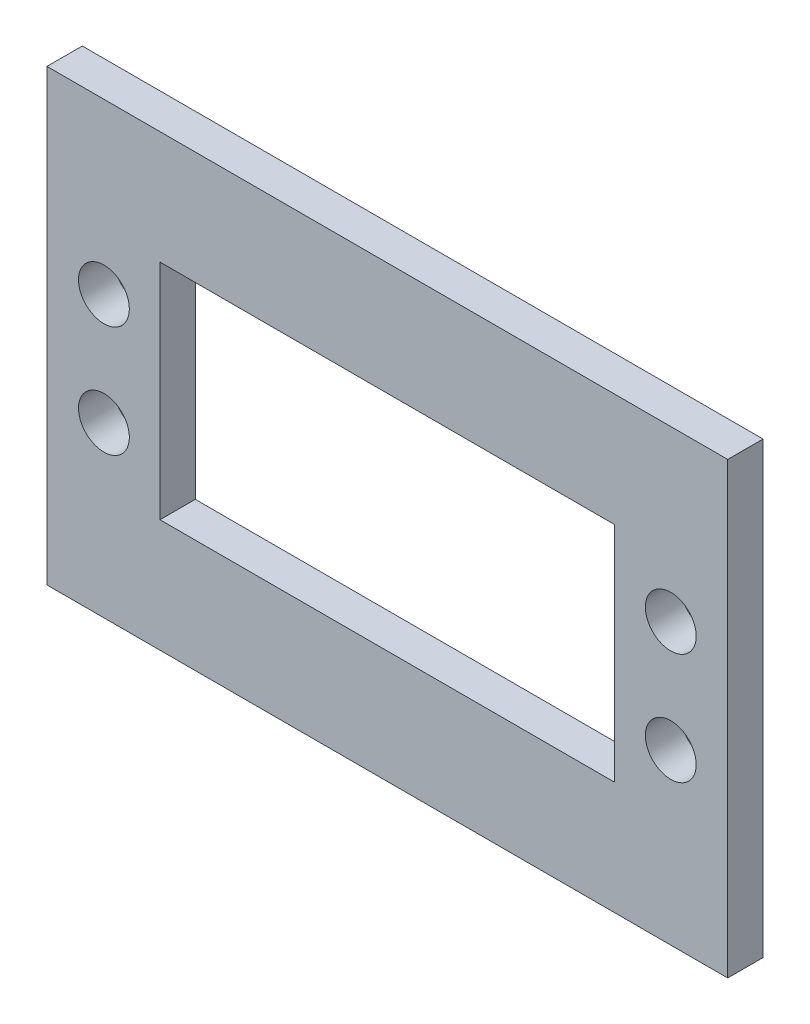
ISO-10303-21;
HEADER;
FILE_DESCRIPTION(('STEP AP214'),'2;1');
FILE_NAME('part.step','',(''),(''),'','','');
FILE_SCHEMA(('AUTOMOTIVE_DESIGN { 1 0 10303 214 1 1 1 1 }'));
ENDSEC;
DATA;
#1=APPLICATION_CONTEXT('core data for automotive mechanical design processes');
#2=APPLICATION_PROTOCOL_DEFINITION('international standard','automotive_design',2000,#1);
#3=PRODUCT_CONTEXT('',#1,'mechanical');
#4=PRODUCT('Part','Part','',(#3));
#5=PRODUCT_RELATED_PRODUCT_CATEGORY('part','',(#4));
#6=PRODUCT_DEFINITION_FORMATION('','',#4);
#7=PRODUCT_DEFINITION_CONTEXT('part definition',#1,'design');
#8=PRODUCT_DEFINITION('design','',#6,#7);
#9=PRODUCT_DEFINITION_SHAPE('','',#8);
#10=(LENGTH_UNIT() NAMED_UNIT(*) SI_UNIT(.MILLI.,.METRE.));
#11=(NAMED_UNIT(*) PLANE_ANGLE_UNIT() SI_UNIT($,.RADIAN.));
#12=(NAMED_UNIT(*) SI_UNIT($,.STERADIAN.) SOLID_ANGLE_UNIT());
#13=UNCERTAINTY_MEASURE_WITH_UNIT(LENGTH_MEASURE(1.E-05),#10,'distance_accuracy_value','');
#14=(GEOMETRIC_REPRESENTATION_CONTEXT(3) GLOBAL_UNCERTAINTY_ASSIGNED_CONTEXT((#13)) GLOBAL_UNIT_ASSIGNED_CONTEXT((#10,
#11,#12)) REPRESENTATION_CONTEXT('',''));
#15=CARTESIAN_POINT('',(0.,0.,0.));
#16=DIRECTION('',(0.,0.,1.));
#17=DIRECTION('',(1.,0.,0.));
#18=AXIS2_PLACEMENT_3D('',#15,#16,#17);
#19=CARTESIAN_POINT('',(0.,0.,3.175));
#20=DIRECTION('',(0.,0.,1.));
#21=DIRECTION('',(1.,0.,0.));
#22=AXIS2_PLACEMENT_3D('',#19,#20,#21);
#23=PLANE('',#22);
#24=CARTESIAN_POINT('',(45.934,15.033,3.175));
#25=DIRECTION('',(0.,0.,1.));
#26=DIRECTION('',(-1.,0.,0.));
#27=AXIS2_PLACEMENT_3D('',#24,#25,#26);
#28=CIRCLE('',#27,2.28599999999999);
#29=CARTESIAN_POINT('',(43.648,15.033,3.175));
#30=VERTEX_POINT('',#29);
#31=EDGE_CURVE('E255',#30,#30,#28,.T.);
#32=ORIENTED_EDGE('',*,*,#31,.F.);
#33=EDGE_LOOP('',(#32));
#34=FACE_BOUND('',#33,.T.);
#35=CARTESIAN_POINT('',(45.934,5.03300000000001,3.175));
#36=DIRECTION('',(0.,0.,1.));
#37=DIRECTION('',(1.,0.,0.));
#38=AXIS2_PLACEMENT_3D('',#35,#36,#37);
#39=CIRCLE('',#38,2.286);
#40=CARTESIAN_POINT('',(48.22,5.03300000000001,3.175));
#41=VERTEX_POINT('',#40);
#42=EDGE_CURVE('E247',#41,#41,#39,.T.);
#43=ORIENTED_EDGE('',*,*,#42,.F.);
#44=EDGE_LOOP('',(#43));
#45=FACE_BOUND('',#44,.T.);
#46=CARTESIAN_POINT('',(-5.04,5.033,3.175));
#47=DIRECTION('',(0.,0.,1.));
#48=DIRECTION('',(-1.,0.,0.));
#49=AXIS2_PLACEMENT_3D('',#46,#47,#48);
#50=CIRCLE('',#49,2.286);
#51=CARTESIAN_POINT('',(-7.326,5.033,3.175));
#52=VERTEX_POINT('',#51);
#53=EDGE_CURVE('E240',#52,#52,#50,.T.);
#54=ORIENTED_EDGE('',*,*,#53,.F.);
#55=EDGE_LOOP('',(#54));
#56=FACE_BOUND('',#55,.T.);
#57=CARTESIAN_POINT('',(-5.04,15.033,3.175));
#58=DIRECTION('',(0.,0.,1.));
#59=DIRECTION('',(1.,0.,0.));
#60=AXIS2_PLACEMENT_3D('',#57,#58,#59);
#61=CIRCLE('',#60,2.286);
#62=CARTESIAN_POINT('',(-2.754,15.033,3.175));
#63=VERTEX_POINT('',#62);
#64=EDGE_CURVE('E244',#63,#63,#61,.T.);
#65=ORIENTED_EDGE('',*,*,#64,.F.);
#66=EDGE_LOOP('',(#65));
#67=FACE_BOUND('',#66,.T.);
#68=DIRECTION('',(1.,0.,0.));
#69=VECTOR('',#68,1.);
#70=CARTESIAN_POINT('',(-10.16,-10.16,3.175));
#71=LINE('',#70,#69);
#72=CARTESIAN_POINT('',(-10.16,-10.16,3.175));
#73=VERTEX_POINT('',#72);
#74=CARTESIAN_POINT('',(51.054,-10.16,3.175));
#75=VERTEX_POINT('',#74);
#76=EDGE_CURVE('E137',#73,#75,#71,.T.);
#77=ORIENTED_EDGE('',*,*,#76,.T.);
#78=DIRECTION('',(0.,1.,0.));
#79=VECTOR('',#78,1.);
#80=CARTESIAN_POINT('',(51.054,-10.16,3.175));
#81=LINE('',#80,#79);
#82=CARTESIAN_POINT('',(51.054,30.226,3.175));
#83=VERTEX_POINT('',#82);
#84=EDGE_CURVE('E140',#75,#83,#81,.T.);
#85=ORIENTED_EDGE('',*,*,#84,.T.);
#86=DIRECTION('',(-1.,0.,0.));
#87=VECTOR('',#86,1.);
#88=CARTESIAN_POINT('',(-10.16,30.226,3.175));
#89=LINE('',#88,#87);
#90=CARTESIAN_POINT('',(-10.16,30.226,3.175));
#91=VERTEX_POINT('',#90);
#92=EDGE_CURVE('E143',#83,#91,#89,.T.);
#93=ORIENTED_EDGE('',*,*,#92,.T.);
#94=DIRECTION('',(0.,-1.,0.));
#95=VECTOR('',#94,1.);
#96=CARTESIAN_POINT('',(-10.16,-10.16,3.175));
#97=LINE('',#96,#95);
#98=EDGE_CURVE('E145',#91,#73,#97,.T.);
#99=ORIENTED_EDGE('',*,*,#98,.T.);
#100=EDGE_LOOP('',(#77,#85,#93,#99));
#101=FACE_BOUND('',#100,.T.);
#102=DIRECTION('',(1.,0.,0.));
#103=VECTOR('',#102,1.);
#104=CARTESIAN_POINT('',(0.,0.,3.175));
#105=LINE('',#104,#103);
#106=CARTESIAN_POINT('',(0.,0.,3.175));
#107=VERTEX_POINT('',#106);
#108=CARTESIAN_POINT('',(40.894,0.,3.175));
#109=VERTEX_POINT('',#108);
#110=EDGE_CURVE('E107',#107,#109,#105,.T.);
#111=ORIENTED_EDGE('',*,*,#110,.F.);
#112=DIRECTION('',(0.,-1.,0.));
#113=VECTOR('',#112,1.);
#114=CARTESIAN_POINT('',(0.,0.,3.175));
#115=LINE('',#114,#113);
#116=CARTESIAN_POINT('',(0.,20.066,3.175));
#117=VERTEX_POINT('',#116);
#118=EDGE_CURVE('E99',#117,#107,#115,.T.);
#119=ORIENTED_EDGE('',*,*,#118,.F.);
#120=DIRECTION('',(-1.,0.,0.));
#121=VECTOR('',#120,1.);
#122=CARTESIAN_POINT('',(0.,20.066,3.175));
#123=LINE('',#122,#121);
#124=CARTESIAN_POINT('',(40.894,20.066,3.175));
#125=VERTEX_POINT('',#124);
#126=EDGE_CURVE('E121',#125,#117,#123,.T.);
#127=ORIENTED_EDGE('',*,*,#126,.F.);
#128=DIRECTION('',(0.,1.,0.));
#129=VECTOR('',#128,1.);
#130=CARTESIAN_POINT('',(40.894,0.,3.175));
#131=LINE('',#130,#129);
#132=EDGE_CURVE('E119',#109,#125,#131,.T.);
#133=ORIENTED_EDGE('',*,*,#132,.F.);
#134=EDGE_LOOP('',(#111,#119,#127,#133));
#135=FACE_BOUND('',#134,.T.);
#136=ADVANCED_FACE('F34',(#34,#45,#56,#67,#101,#135),#23,.T.);
#137=CARTESIAN_POINT('',(0.,0.,0.));
#138=DIRECTION('',(0.,0.,1.));
#139=DIRECTION('',(1.,0.,0.));
#140=AXIS2_PLACEMENT_3D('',#137,#138,#139);
#141=PLANE('',#140);
#142=CARTESIAN_POINT('',(45.934,15.033,0.));
#143=DIRECTION('',(0.,0.,1.));
#144=DIRECTION('',(-1.,0.,0.));
#145=AXIS2_PLACEMENT_3D('',#142,#143,#144);
#146=CIRCLE('',#145,2.28599999999999);
#147=CARTESIAN_POINT('',(43.648,15.033,0.));
#148=VERTEX_POINT('',#147);
#149=EDGE_CURVE('E252',#148,#148,#146,.T.);
#150=ORIENTED_EDGE('',*,*,#149,.T.);
#151=EDGE_LOOP('',(#150));
#152=FACE_BOUND('',#151,.T.);
#153=CARTESIAN_POINT('',(45.934,5.03300000000001,0.));
#154=DIRECTION('',(0.,0.,1.));
#155=DIRECTION('',(1.,0.,0.));
#156=AXIS2_PLACEMENT_3D('',#153,#154,#155);
#157=CIRCLE('',#156,2.286);
#158=CARTESIAN_POINT('',(48.22,5.03300000000001,0.));
#159=VERTEX_POINT('',#158);
#160=EDGE_CURVE('E242',#159,#159,#157,.T.);
#161=ORIENTED_EDGE('',*,*,#160,.T.);
#162=EDGE_LOOP('',(#161));
#163=FACE_BOUND('',#162,.T.);
#164=CARTESIAN_POINT('',(-5.04,5.033,0.));
#165=DIRECTION('',(0.,0.,1.));
#166=DIRECTION('',(-1.,0.,0.));
#167=AXIS2_PLACEMENT_3D('',#164,#165,#166);
#168=CIRCLE('',#167,2.286);
#169=CARTESIAN_POINT('',(-7.326,5.033,0.));
#170=VERTEX_POINT('',#169);
#171=EDGE_CURVE('E237',#170,#170,#168,.T.);
#172=ORIENTED_EDGE('',*,*,#171,.T.);
#173=EDGE_LOOP('',(#172));
#174=FACE_BOUND('',#173,.T.);
#175=CARTESIAN_POINT('',(-5.04,15.033,0.));
#176=DIRECTION('',(0.,0.,1.));
#177=DIRECTION('',(1.,0.,0.));
#178=AXIS2_PLACEMENT_3D('',#175,#176,#177);
#179=CIRCLE('',#178,2.286);
#180=CARTESIAN_POINT('',(-2.754,15.033,0.));
#181=VERTEX_POINT('',#180);
#182=EDGE_CURVE('E127',#181,#181,#179,.T.);
#183=ORIENTED_EDGE('',*,*,#182,.T.);
#184=EDGE_LOOP('',(#183));
#185=FACE_BOUND('',#184,.T.);
#186=DIRECTION('',(1.,0.,0.));
#187=VECTOR('',#186,1.);
#188=CARTESIAN_POINT('',(-10.16,-10.16,0.));
#189=LINE('',#188,#187);
#190=CARTESIAN_POINT('',(-10.16,-10.16,0.));
#191=VERTEX_POINT('',#190);
#192=CARTESIAN_POINT('',(51.054,-10.16,0.));
#193=VERTEX_POINT('',#192);
#194=EDGE_CURVE('E115',#191,#193,#189,.T.);
#195=ORIENTED_EDGE('',*,*,#194,.F.);
#196=DIRECTION('',(0.,-1.,0.));
#197=VECTOR('',#196,1.);
#198=CARTESIAN_POINT('',(-10.16,-10.16,0.));
#199=LINE('',#198,#197);
#200=CARTESIAN_POINT('',(-10.16,30.226,0.));
#201=VERTEX_POINT('',#200);
#202=EDGE_CURVE('E141',#201,#191,#199,.T.);
#203=ORIENTED_EDGE('',*,*,#202,.F.);
#204=DIRECTION('',(-1.,0.,0.));
#205=VECTOR('',#204,1.);
#206=CARTESIAN_POINT('',(-10.16,30.226,0.));
#207=LINE('',#206,#205);
#208=CARTESIAN_POINT('',(51.054,30.226,0.));
#209=VERTEX_POINT('',#208);
#210=EDGE_CURVE('E152',#209,#201,#207,.T.);
#211=ORIENTED_EDGE('',*,*,#210,.F.);
#212=DIRECTION('',(0.,1.,0.));
#213=VECTOR('',#212,1.);
#214=CARTESIAN_POINT('',(51.054,-10.16,0.));
#215=LINE('',#214,#213);
#216=EDGE_CURVE('E150',#193,#209,#215,.T.);
#217=ORIENTED_EDGE('',*,*,#216,.F.);
#218=EDGE_LOOP('',(#195,#203,#211,#217));
#219=FACE_BOUND('',#218,.T.);
#220=DIRECTION('',(0.,-1.,0.));
#221=VECTOR('',#220,1.);
#222=CARTESIAN_POINT('',(0.,0.,0.));
#223=LINE('',#222,#221);
#224=CARTESIAN_POINT('',(0.,20.066,0.));
#225=VERTEX_POINT('',#224);
#226=CARTESIAN_POINT('',(0.,0.,0.));
#227=VERTEX_POINT('',#226);
#228=EDGE_CURVE('E57',#225,#227,#223,.T.);
#229=ORIENTED_EDGE('',*,*,#228,.T.);
#230=DIRECTION('',(1.,0.,0.));
#231=VECTOR('',#230,1.);
#232=CARTESIAN_POINT('',(0.,0.,0.));
#233=LINE('',#232,#231);
#234=CARTESIAN_POINT('',(40.894,0.,0.));
#235=VERTEX_POINT('',#234);
#236=EDGE_CURVE('E114',#227,#235,#233,.T.);
#237=ORIENTED_EDGE('',*,*,#236,.T.);
#238=DIRECTION('',(0.,1.,0.));
#239=VECTOR('',#238,1.);
#240=CARTESIAN_POINT('',(40.894,0.,0.));
#241=LINE('',#240,#239);
#242=CARTESIAN_POINT('',(40.894,20.066,0.));
#243=VERTEX_POINT('',#242);
#244=EDGE_CURVE('E129',#235,#243,#241,.T.);
#245=ORIENTED_EDGE('',*,*,#244,.T.);
#246=DIRECTION('',(-1.,0.,0.));
#247=VECTOR('',#246,1.);
#248=CARTESIAN_POINT('',(0.,20.066,0.));
#249=LINE('',#248,#247);
#250=EDGE_CURVE('E108',#243,#225,#249,.T.);
#251=ORIENTED_EDGE('',*,*,#250,.T.);
#252=EDGE_LOOP('',(#229,#237,#245,#251));
#253=FACE_BOUND('',#252,.T.);
#254=ADVANCED_FACE('F170',(#152,#163,#174,#185,#219,#253),#141,.F.);
#255=CARTESIAN_POINT('',(-10.16,-10.16,3.175));
#256=DIRECTION('',(0.,1.,0.));
#257=DIRECTION('',(0.,0.,1.));
#258=AXIS2_PLACEMENT_3D('',#255,#256,#257);
#259=PLANE('',#258);
#260=ORIENTED_EDGE('',*,*,#194,.T.);
#261=DIRECTION('',(0.,0.,-1.));
#262=VECTOR('',#261,1.);
#263=CARTESIAN_POINT('',(51.054,-10.16,3.175));
#264=LINE('',#263,#262);
#265=EDGE_CURVE('E11',#75,#193,#264,.T.);
#266=ORIENTED_EDGE('',*,*,#265,.F.);
#267=ORIENTED_EDGE('',*,*,#76,.F.);
#268=DIRECTION('',(0.,0.,-1.));
#269=VECTOR('',#268,1.);
#270=CARTESIAN_POINT('',(-10.16,-10.16,3.175));
#271=LINE('',#270,#269);
#272=EDGE_CURVE('E147',#73,#191,#271,.T.);
#273=ORIENTED_EDGE('',*,*,#272,.T.);
#274=EDGE_LOOP('',(#260,#266,#267,#273));
#275=FACE_BOUND('',#274,.T.);
#276=ADVANCED_FACE('F36',(#275),#259,.F.);
#277=CARTESIAN_POINT('',(51.054,-10.16,3.175));
#278=DIRECTION('',(-1.,0.,0.));
#279=DIRECTION('',(0.,0.,1.));
#280=AXIS2_PLACEMENT_3D('',#277,#278,#279);
#281=PLANE('',#280);
#282=ORIENTED_EDGE('',*,*,#216,.T.);
#283=DIRECTION('',(0.,0.,-1.));
#284=VECTOR('',#283,1.);
#285=CARTESIAN_POINT('',(51.054,30.226,3.175));
#286=LINE('',#285,#284);
#287=EDGE_CURVE('E42',#83,#209,#286,.T.);
#288=ORIENTED_EDGE('',*,*,#287,.F.);
#289=ORIENTED_EDGE('',*,*,#84,.F.);
#290=ORIENTED_EDGE('',*,*,#265,.T.);
#291=EDGE_LOOP('',(#282,#288,#289,#290));
#292=FACE_BOUND('',#291,.T.);
#293=ADVANCED_FACE('F180',(#292),#281,.F.);
#294=CARTESIAN_POINT('',(-10.16,30.226,3.175));
#295=DIRECTION('',(0.,-1.,0.));
#296=DIRECTION('',(0.,0.,-1.));
#297=AXIS2_PLACEMENT_3D('',#294,#295,#296);
#298=PLANE('',#297);
#299=ORIENTED_EDGE('',*,*,#210,.T.);
#300=DIRECTION('',(0.,0.,-1.));
#301=VECTOR('',#300,1.);
#302=CARTESIAN_POINT('',(-10.16,30.226,3.175));
#303=LINE('',#302,#301);
#304=EDGE_CURVE('E157',#91,#201,#303,.T.);
#305=ORIENTED_EDGE('',*,*,#304,.F.);
#306=ORIENTED_EDGE('',*,*,#92,.F.);
#307=ORIENTED_EDGE('',*,*,#287,.T.);
#308=EDGE_LOOP('',(#299,#305,#306,#307));
#309=FACE_BOUND('',#308,.T.);
#310=ADVANCED_FACE('F164',(#309),#298,.F.);
#311=CARTESIAN_POINT('',(-10.16,-10.16,3.175));
#312=DIRECTION('',(1.,0.,0.));
#313=DIRECTION('',(0.,0.,-1.));
#314=AXIS2_PLACEMENT_3D('',#311,#312,#313);
#315=PLANE('',#314);
#316=ORIENTED_EDGE('',*,*,#202,.T.);
#317=ORIENTED_EDGE('',*,*,#272,.F.);
#318=ORIENTED_EDGE('',*,*,#98,.F.);
#319=ORIENTED_EDGE('',*,*,#304,.T.);
#320=EDGE_LOOP('',(#316,#317,#318,#319));
#321=FACE_BOUND('',#320,.T.);
#322=ADVANCED_FACE('F174',(#321),#315,.F.);
#323=CARTESIAN_POINT('',(0.,0.,3.175));
#324=DIRECTION('',(1.,0.,0.));
#325=DIRECTION('',(0.,0.,-1.));
#326=AXIS2_PLACEMENT_3D('',#323,#324,#325);
#327=PLANE('',#326);
#328=ORIENTED_EDGE('',*,*,#228,.F.);
#329=DIRECTION('',(0.,0.,-1.));
#330=VECTOR('',#329,1.);
#331=CARTESIAN_POINT('',(0.,20.066,3.175));
#332=LINE('',#331,#330);
#333=EDGE_CURVE('E103',#117,#225,#332,.T.);
#334=ORIENTED_EDGE('',*,*,#333,.F.);
#335=ORIENTED_EDGE('',*,*,#118,.T.);
#336=DIRECTION('',(0.,0.,-1.));
#337=VECTOR('',#336,1.);
#338=CARTESIAN_POINT('',(0.,0.,3.175));
#339=LINE('',#338,#337);
#340=EDGE_CURVE('E102',#107,#227,#339,.T.);
#341=ORIENTED_EDGE('',*,*,#340,.T.);
#342=EDGE_LOOP('',(#328,#334,#335,#341));
#343=FACE_BOUND('',#342,.T.);
#344=ADVANCED_FACE('F101',(#343),#327,.T.);
#345=CARTESIAN_POINT('',(0.,0.,3.175));
#346=DIRECTION('',(0.,1.,0.));
#347=DIRECTION('',(0.,0.,1.));
#348=AXIS2_PLACEMENT_3D('',#345,#346,#347);
#349=PLANE('',#348);
#350=ORIENTED_EDGE('',*,*,#236,.F.);
#351=ORIENTED_EDGE('',*,*,#340,.F.);
#352=ORIENTED_EDGE('',*,*,#110,.T.);
#353=DIRECTION('',(0.,0.,-1.));
#354=VECTOR('',#353,1.);
#355=CARTESIAN_POINT('',(40.894,0.,3.175));
#356=LINE('',#355,#354);
#357=EDGE_CURVE('E116',#109,#235,#356,.T.);
#358=ORIENTED_EDGE('',*,*,#357,.T.);
#359=EDGE_LOOP('',(#350,#351,#352,#358));
#360=FACE_BOUND('',#359,.T.);
#361=ADVANCED_FACE('F111',(#360),#349,.T.);
#362=CARTESIAN_POINT('',(40.894,0.,3.175));
#363=DIRECTION('',(-1.,0.,0.));
#364=DIRECTION('',(0.,0.,1.));
#365=AXIS2_PLACEMENT_3D('',#362,#363,#364);
#366=PLANE('',#365);
#367=ORIENTED_EDGE('',*,*,#244,.F.);
#368=ORIENTED_EDGE('',*,*,#357,.F.);
#369=ORIENTED_EDGE('',*,*,#132,.T.);
#370=DIRECTION('',(0.,0.,-1.));
#371=VECTOR('',#370,1.);
#372=CARTESIAN_POINT('',(40.894,20.066,3.175));
#373=LINE('',#372,#371);
#374=EDGE_CURVE('E49',#125,#243,#373,.T.);
#375=ORIENTED_EDGE('',*,*,#374,.T.);
#376=EDGE_LOOP('',(#367,#368,#369,#375));
#377=FACE_BOUND('',#376,.T.);
#378=ADVANCED_FACE('F207',(#377),#366,.T.);
#379=CARTESIAN_POINT('',(0.,20.066,3.175));
#380=DIRECTION('',(0.,-1.,0.));
#381=DIRECTION('',(0.,0.,-1.));
#382=AXIS2_PLACEMENT_3D('',#379,#380,#381);
#383=PLANE('',#382);
#384=ORIENTED_EDGE('',*,*,#250,.F.);
#385=ORIENTED_EDGE('',*,*,#374,.F.);
#386=ORIENTED_EDGE('',*,*,#126,.T.);
#387=ORIENTED_EDGE('',*,*,#333,.T.);
#388=EDGE_LOOP('',(#384,#385,#386,#387));
#389=FACE_BOUND('',#388,.T.);
#390=ADVANCED_FACE('F211',(#389),#383,.T.);
#391=CARTESIAN_POINT('',(-5.04,15.033,0.));
#392=DIRECTION('',(0.,0.,1.));
#393=DIRECTION('',(1.,0.,0.));
#394=AXIS2_PLACEMENT_3D('',#391,#392,#393);
#395=CYLINDRICAL_SURFACE('',#394,2.286);
#396=ORIENTED_EDGE('',*,*,#182,.F.);
#397=EDGE_LOOP('',(#396));
#398=FACE_BOUND('',#397,.T.);
#399=ORIENTED_EDGE('',*,*,#64,.T.);
#400=EDGE_LOOP('',(#399));
#401=FACE_BOUND('',#400,.T.);
#402=ADVANCED_FACE('F217',(#398,#401),#395,.F.);
#403=CARTESIAN_POINT('',(-5.04,5.033,0.));
#404=DIRECTION('',(0.,0.,1.));
#405=DIRECTION('',(1.,0.,0.));
#406=AXIS2_PLACEMENT_3D('',#403,#404,#405);
#407=CYLINDRICAL_SURFACE('',#406,2.286);
#408=ORIENTED_EDGE('',*,*,#171,.F.);
#409=EDGE_LOOP('',(#408));
#410=FACE_BOUND('',#409,.T.);
#411=ORIENTED_EDGE('',*,*,#53,.T.);
#412=EDGE_LOOP('',(#411));
#413=FACE_BOUND('',#412,.T.);
#414=ADVANCED_FACE('F220',(#410,#413),#407,.F.);
#415=CARTESIAN_POINT('',(45.934,5.03300000000001,0.));
#416=DIRECTION('',(0.,0.,1.));
#417=DIRECTION('',(1.,0.,0.));
#418=AXIS2_PLACEMENT_3D('',#415,#416,#417);
#419=CYLINDRICAL_SURFACE('',#418,2.286);
#420=ORIENTED_EDGE('',*,*,#160,.F.);
#421=EDGE_LOOP('',(#420));
#422=FACE_BOUND('',#421,.T.);
#423=ORIENTED_EDGE('',*,*,#42,.T.);
#424=EDGE_LOOP('',(#423));
#425=FACE_BOUND('',#424,.T.);
#426=ADVANCED_FACE('F225',(#422,#425),#419,.F.);
#427=CARTESIAN_POINT('',(45.934,15.033,0.));
#428=DIRECTION('',(0.,0.,1.));
#429=DIRECTION('',(1.,0.,0.));
#430=AXIS2_PLACEMENT_3D('',#427,#428,#429);
#431=CYLINDRICAL_SURFACE('',#430,2.28599999999999);
#432=ORIENTED_EDGE('',*,*,#149,.F.);
#433=EDGE_LOOP('',(#432));
#434=FACE_BOUND('',#433,.T.);
#435=ORIENTED_EDGE('',*,*,#31,.T.);
#436=EDGE_LOOP('',(#435));
#437=FACE_BOUND('',#436,.T.);
#438=ADVANCED_FACE('F222',(#434,#437),#431,.F.);
#439=CLOSED_SHELL('',(#136,#254,#276,#293,#310,#322,#344,#361,#378,#390,#402,#414,#426,#438));
#440=MANIFOLD_SOLID_BREP('B2',#439);
#441=ADVANCED_BREP_SHAPE_REPRESENTATION('',(#18,#440),#14);
#442=SHAPE_DEFINITION_REPRESENTATION(#9,#441);
ENDSEC;
END-ISO-10303-21;
